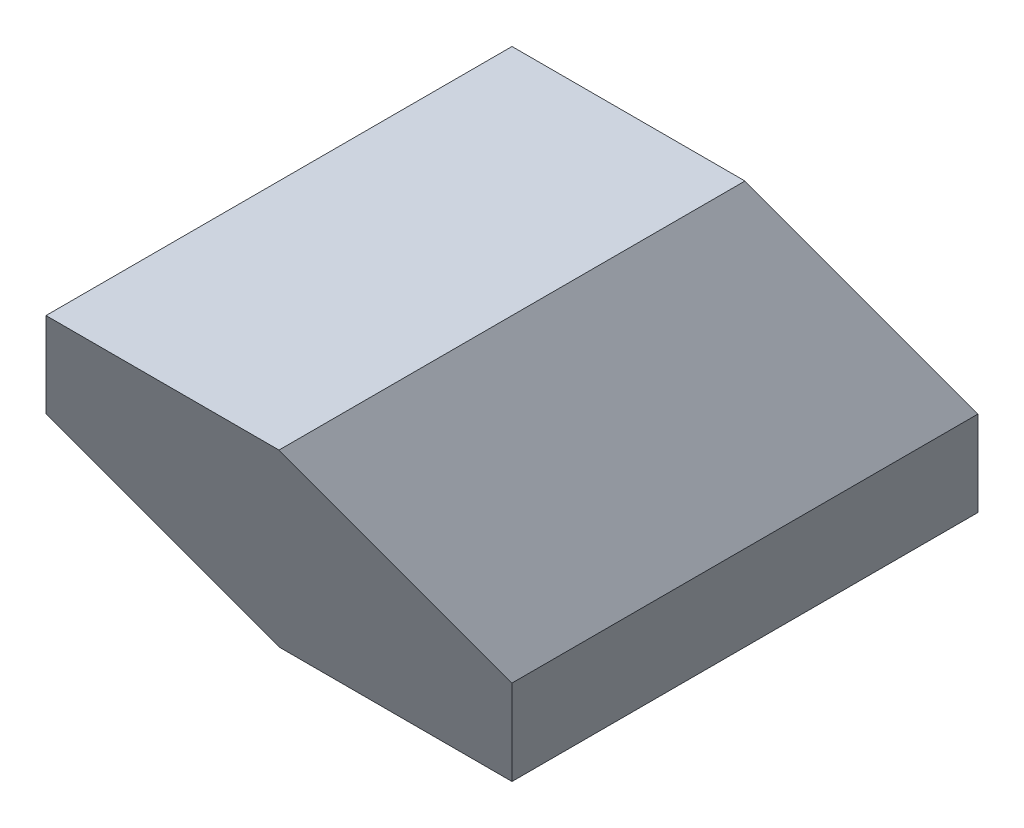
ISO-10303-21;
HEADER;
FILE_DESCRIPTION(('STEP AP214'),'2;1');
FILE_NAME('part.step','',(''),(''),'','','');
FILE_SCHEMA(('AUTOMOTIVE_DESIGN { 1 0 10303 214 1 1 1 1 }'));
ENDSEC;
DATA;
#1=APPLICATION_CONTEXT('core data for automotive mechanical design processes');
#2=APPLICATION_PROTOCOL_DEFINITION('international standard','automotive_design',2000,#1);
#3=PRODUCT_CONTEXT('',#1,'mechanical');
#4=PRODUCT('Part','Part','',(#3));
#5=PRODUCT_RELATED_PRODUCT_CATEGORY('part','',(#4));
#6=PRODUCT_DEFINITION_FORMATION('','',#4);
#7=PRODUCT_DEFINITION_CONTEXT('part definition',#1,'design');
#8=PRODUCT_DEFINITION('design','',#6,#7);
#9=PRODUCT_DEFINITION_SHAPE('','',#8);
#10=(LENGTH_UNIT() NAMED_UNIT(*) SI_UNIT(.MILLI.,.METRE.));
#11=(NAMED_UNIT(*) PLANE_ANGLE_UNIT() SI_UNIT($,.RADIAN.));
#12=(NAMED_UNIT(*) SI_UNIT($,.STERADIAN.) SOLID_ANGLE_UNIT());
#13=UNCERTAINTY_MEASURE_WITH_UNIT(LENGTH_MEASURE(1.E-05),#10,'distance_accuracy_value','');
#14=(GEOMETRIC_REPRESENTATION_CONTEXT(3) GLOBAL_UNCERTAINTY_ASSIGNED_CONTEXT((#13)) GLOBAL_UNIT_ASSIGNED_CONTEXT((#10,
#11,#12)) REPRESENTATION_CONTEXT('',''));
#15=CARTESIAN_POINT('',(0.,0.,0.));
#16=DIRECTION('',(0.,0.,1.));
#17=DIRECTION('',(1.,0.,0.));
#18=AXIS2_PLACEMENT_3D('',#15,#16,#17);
#19=CARTESIAN_POINT('',(0.,0.,0.));
#20=DIRECTION('',(0.,1.,0.));
#21=DIRECTION('',(1.,0.,0.));
#22=AXIS2_PLACEMENT_3D('',#19,#20,#21);
#23=SPHERICAL_SURFACE('',#22,34.9999999999999);
#24=CARTESIAN_POINT('',(0.,-17.4999999999999,30.3108891324553));
#25=VERTEX_POINT('',#24);
#26=VERTEX_LOOP('',#25);
#27=FACE_BOUND('',#26,.T.);
#28=CARTESIAN_POINT('',(0.,17.5000000000003,-30.310889132455));
#29=VERTEX_POINT('',#28);
#30=VERTEX_LOOP('',#29);
#31=FACE_BOUND('',#30,.T.);
#32=ADVANCED_FACE('F40',(#27,#31),#23,.T.);
#33=CLOSED_SHELL('',(#32));
#34=MANIFOLD_SOLID_BREP('B2',#33);
#35=CARTESIAN_POINT('',(20.2072594216366,-35.,65.));
#36=DIRECTION('',(-0.866025403784435,0.500000000000006,0.));
#37=DIRECTION('',(-0.500000000000006,-0.866025403784435,0.));
#38=AXIS2_PLACEMENT_3D('',#35,#36,#37);
#39=PLANE('',#38);
#40=DIRECTION('',(0.,0.,-1.));
#41=VECTOR('',#40,1.);
#42=CARTESIAN_POINT('',(40.4145188432736,-2.70616862252382E-13,65.));
#43=LINE('',#42,#41);
#44=CARTESIAN_POINT('',(40.4145188432736,-2.70616862252382E-13,40.4145188432737));
#45=VERTEX_POINT('',#44);
#46=CARTESIAN_POINT('',(40.4145188432736,-2.77555756156289E-13,-40.4145188432744));
#47=VERTEX_POINT('',#46);
#48=EDGE_CURVE('E38',#45,#47,#43,.T.);
#49=ORIENTED_EDGE('',*,*,#48,.F.);
#50=DIRECTION('',(-0.447213595499964,-0.774596669241482,-0.447213595499955));
#51=VECTOR('',#50,1.);
#52=CARTESIAN_POINT('',(29.1658075373092,-19.4833395016048,29.1658075373096));
#53=LINE('',#52,#51);
#54=CARTESIAN_POINT('',(20.2072594216366,-35.,20.2072594216371));
#55=VERTEX_POINT('',#54);
#56=EDGE_CURVE('E110',#45,#55,#53,.T.);
#57=ORIENTED_EDGE('',*,*,#56,.T.);
#58=DIRECTION('',(0.,0.,-1.));
#59=VECTOR('',#58,1.);
#60=CARTESIAN_POINT('',(20.2072594216366,-35.,65.));
#61=LINE('',#60,#59);
#62=CARTESIAN_POINT('',(20.2072594216366,-35.,-60.6217782649116));
#63=VERTEX_POINT('',#62);
#64=EDGE_CURVE('E80',#55,#63,#61,.T.);
#65=ORIENTED_EDGE('',*,*,#64,.T.);
#66=DIRECTION('',(0.447213595499961,0.774596669241477,0.447213595499966));
#67=VECTOR('',#66,1.);
#68=CARTESIAN_POINT('',(45.3316150746195,8.51666049839615,-35.4974226119284));
#69=LINE('',#68,#67);
#70=EDGE_CURVE('E125',#63,#47,#69,.T.);
#71=ORIENTED_EDGE('',*,*,#70,.T.);
#72=EDGE_LOOP('',(#49,#57,#65,#71));
#73=FACE_BOUND('',#72,.T.);
#74=ADVANCED_FACE('F58',(#73),#39,.F.);
#75=CARTESIAN_POINT('',(40.4145188432736,-2.70616862252382E-13,65.));
#76=DIRECTION('',(-0.866025403784442,-0.499999999999994,0.));
#77=DIRECTION('',(0.499999999999994,-0.866025403784442,0.));
#78=AXIS2_PLACEMENT_3D('',#75,#76,#77);
#79=PLANE('',#78);
#80=DIRECTION('',(0.,0.,-1.));
#81=VECTOR('',#80,1.);
#82=CARTESIAN_POINT('',(20.2072594216371,34.9999999999997,65.));
#83=LINE('',#82,#81);
#84=CARTESIAN_POINT('',(20.207259421637,34.9999999999997,60.6217782649105));
#85=VERTEX_POINT('',#84);
#86=CARTESIAN_POINT('',(20.207259421637,34.9999999999997,-20.207259421637));
#87=VERTEX_POINT('',#86);
#88=EDGE_CURVE('E65',#85,#87,#83,.T.);
#89=ORIENTED_EDGE('',*,*,#88,.F.);
#90=DIRECTION('',(0.447213595499953,-0.774596669241487,-0.447213595499957));
#91=VECTOR('',#90,1.);
#92=CARTESIAN_POINT('',(35.4974226119284,8.51666049839517,45.331615074619));
#93=LINE('',#92,#91);
#94=EDGE_CURVE('E118',#85,#45,#93,.T.);
#95=ORIENTED_EDGE('',*,*,#94,.T.);
#96=ORIENTED_EDGE('',*,*,#48,.T.);
#97=DIRECTION('',(-0.44721359549995,0.774596669241482,0.447213595499969));
#98=VECTOR('',#97,1.);
#99=CARTESIAN_POINT('',(19.3316150746186,36.5166604983961,-19.3316150746185));
#100=LINE('',#99,#98);
#101=EDGE_CURVE('E129',#47,#87,#100,.T.);
#102=ORIENTED_EDGE('',*,*,#101,.T.);
#103=EDGE_LOOP('',(#89,#95,#96,#102));
#104=FACE_BOUND('',#103,.T.);
#105=ADVANCED_FACE('F152',(#104),#79,.F.);
#106=CARTESIAN_POINT('',(20.2072594216371,34.9999999999997,65.));
#107=DIRECTION('',(0.,-1.,0.));
#108=DIRECTION('',(1.,0.,0.));
#109=AXIS2_PLACEMENT_3D('',#106,#107,#108);
#110=PLANE('',#109);
#111=DIRECTION('',(0.,0.,-1.));
#112=VECTOR('',#111,1.);
#113=CARTESIAN_POINT('',(-20.2072594216366,35.,65.));
#114=LINE('',#113,#112);
#115=CARTESIAN_POINT('',(-20.2072594216367,34.9999999999997,60.6217782649105));
#116=VERTEX_POINT('',#115);
#117=CARTESIAN_POINT('',(-20.2072594216368,34.9999999999997,-20.207259421637));
#118=VERTEX_POINT('',#117);
#119=EDGE_CURVE('E134',#116,#118,#114,.T.);
#120=ORIENTED_EDGE('',*,*,#119,.F.);
#121=DIRECTION('',(1.,0.,0.));
#122=VECTOR('',#121,1.);
#123=CARTESIAN_POINT('',(-45.,34.9999999999997,60.6217782649105));
#124=LINE('',#123,#122);
#125=EDGE_CURVE('E114',#116,#85,#124,.T.);
#126=ORIENTED_EDGE('',*,*,#125,.T.);
#127=ORIENTED_EDGE('',*,*,#88,.T.);
#128=DIRECTION('',(1.,0.,0.));
#129=VECTOR('',#128,1.);
#130=CARTESIAN_POINT('',(-45.,34.9999999999997,-20.207259421637));
#131=LINE('',#130,#129);
#132=EDGE_CURVE('E117',#118,#87,#131,.T.);
#133=ORIENTED_EDGE('',*,*,#132,.F.);
#134=EDGE_LOOP('',(#120,#126,#127,#133));
#135=FACE_BOUND('',#134,.T.);
#136=ADVANCED_FACE('F141',(#135),#110,.F.);
#137=CARTESIAN_POINT('',(-20.2072594216366,35.,65.));
#138=DIRECTION('',(0.866025403784435,-0.500000000000006,0.));
#139=DIRECTION('',(0.500000000000006,0.866025403784435,0.));
#140=AXIS2_PLACEMENT_3D('',#137,#138,#139);
#141=PLANE('',#140);
#142=DIRECTION('',(0.,0.,-1.));
#143=VECTOR('',#142,1.);
#144=CARTESIAN_POINT('',(-40.4145188432736,2.82651506366971E-13,65.));
#145=LINE('',#144,#143);
#146=CARTESIAN_POINT('',(-40.4145188432736,2.8275992658422E-13,40.4145188432741));
#147=VERTEX_POINT('',#146);
#148=CARTESIAN_POINT('',(-40.4145188432736,2.91433543964104E-13,-40.414518843274));
#149=VERTEX_POINT('',#148);
#150=EDGE_CURVE('E127',#147,#149,#145,.T.);
#151=ORIENTED_EDGE('',*,*,#150,.F.);
#152=DIRECTION('',(0.447213595499964,0.774596669241482,0.447213595499955));
#153=VECTOR('',#152,1.);
#154=CARTESIAN_POINT('',(-19.3316150746187,36.5166604983954,61.4974226119285));
#155=LINE('',#154,#153);
#156=EDGE_CURVE('E160',#147,#116,#155,.T.);
#157=ORIENTED_EDGE('',*,*,#156,.T.);
#158=ORIENTED_EDGE('',*,*,#119,.T.);
#159=DIRECTION('',(-0.447213595499961,-0.774596669241477,-0.447213595499966));
#160=VECTOR('',#159,1.);
#161=CARTESIAN_POINT('',(-3.16580753730881,64.5166604983956,-3.16580753730886));
#162=LINE('',#161,#160);
#163=EDGE_CURVE('E150',#118,#149,#162,.T.);
#164=ORIENTED_EDGE('',*,*,#163,.T.);
#165=EDGE_LOOP('',(#151,#157,#158,#164));
#166=FACE_BOUND('',#165,.T.);
#167=ADVANCED_FACE('F168',(#166),#141,.F.);
#168=CARTESIAN_POINT('',(-40.4145188432736,2.82651506366971E-13,65.));
#169=DIRECTION('',(0.866025403784442,0.499999999999994,0.));
#170=DIRECTION('',(-0.499999999999994,0.866025403784442,0.));
#171=AXIS2_PLACEMENT_3D('',#168,#169,#170);
#172=PLANE('',#171);
#173=DIRECTION('',(0.,0.,-1.));
#174=VECTOR('',#173,1.);
#175=CARTESIAN_POINT('',(-20.207259421637,-34.9999999999997,65.));
#176=LINE('',#175,#174);
#177=CARTESIAN_POINT('',(-20.207259421637,-34.9999999999997,20.2072594216372));
#178=VERTEX_POINT('',#177);
#179=CARTESIAN_POINT('',(-20.207259421637,-35.,-60.6217782649116));
#180=VERTEX_POINT('',#179);
#181=EDGE_CURVE('E124',#178,#180,#176,.T.);
#182=ORIENTED_EDGE('',*,*,#181,.F.);
#183=DIRECTION('',(-0.447213595499953,0.774596669241487,0.447213595499957));
#184=VECTOR('',#183,1.);
#185=CARTESIAN_POINT('',(-45.3316150746187,8.51666049839561,45.3316150746193));
#186=LINE('',#185,#184);
#187=EDGE_CURVE('E72',#178,#147,#186,.T.);
#188=ORIENTED_EDGE('',*,*,#187,.T.);
#189=ORIENTED_EDGE('',*,*,#150,.T.);
#190=DIRECTION('',(0.44721359549995,-0.774596669241482,-0.447213595499968));
#191=VECTOR('',#190,1.);
#192=CARTESIAN_POINT('',(-61.4974226119285,36.5166604983966,-19.3316150746182));
#193=LINE('',#192,#191);
#194=EDGE_CURVE('E153',#149,#180,#193,.T.);
#195=ORIENTED_EDGE('',*,*,#194,.T.);
#196=EDGE_LOOP('',(#182,#188,#189,#195));
#197=FACE_BOUND('',#196,.T.);
#198=ADVANCED_FACE('F166',(#197),#172,.F.);
#199=CARTESIAN_POINT('',(-20.207259421637,-34.9999999999997,65.));
#200=DIRECTION('',(0.,1.,0.));
#201=DIRECTION('',(-1.,0.,0.));
#202=AXIS2_PLACEMENT_3D('',#199,#200,#201);
#203=PLANE('',#202);
#204=ORIENTED_EDGE('',*,*,#64,.F.);
#205=DIRECTION('',(1.,0.,0.));
#206=VECTOR('',#205,1.);
#207=CARTESIAN_POINT('',(-45.,-35.,20.2072594216371));
#208=LINE('',#207,#206);
#209=EDGE_CURVE('E108',#178,#55,#208,.T.);
#210=ORIENTED_EDGE('',*,*,#209,.F.);
#211=ORIENTED_EDGE('',*,*,#181,.T.);
#212=DIRECTION('',(1.,0.,0.));
#213=VECTOR('',#212,1.);
#214=CARTESIAN_POINT('',(-45.,-35.,-60.6217782649116));
#215=LINE('',#214,#213);
#216=EDGE_CURVE('E123',#180,#63,#215,.T.);
#217=ORIENTED_EDGE('',*,*,#216,.T.);
#218=EDGE_LOOP('',(#204,#210,#211,#217));
#219=FACE_BOUND('',#218,.T.);
#220=ADVANCED_FACE('F121',(#219),#203,.F.);
#221=CARTESIAN_POINT('',(-45.,34.9999999999997,-20.207259421637));
#222=DIRECTION('',(0.,-0.50000000000001,0.866025403784433));
#223=DIRECTION('',(0.,-0.866025403784433,-0.50000000000001));
#224=AXIS2_PLACEMENT_3D('',#221,#222,#223);
#225=PLANE('',#224);
#226=ORIENTED_EDGE('',*,*,#216,.F.);
#227=ORIENTED_EDGE('',*,*,#194,.F.);
#228=ORIENTED_EDGE('',*,*,#163,.F.);
#229=ORIENTED_EDGE('',*,*,#132,.T.);
#230=ORIENTED_EDGE('',*,*,#101,.F.);
#231=ORIENTED_EDGE('',*,*,#70,.F.);
#232=EDGE_LOOP('',(#226,#227,#228,#229,#230,#231));
#233=FACE_BOUND('',#232,.T.);
#234=ADVANCED_FACE('F147',(#233),#225,.F.);
#235=CARTESIAN_POINT('',(-45.,34.9999999999997,60.6217782649105));
#236=DIRECTION('',(0.,0.499999999999998,-0.86602540378444));
#237=DIRECTION('',(0.,0.86602540378444,0.499999999999998));
#238=AXIS2_PLACEMENT_3D('',#235,#236,#237);
#239=PLANE('',#238);
#240=ORIENTED_EDGE('',*,*,#94,.F.);
#241=ORIENTED_EDGE('',*,*,#125,.F.);
#242=ORIENTED_EDGE('',*,*,#156,.F.);
#243=ORIENTED_EDGE('',*,*,#187,.F.);
#244=ORIENTED_EDGE('',*,*,#209,.T.);
#245=ORIENTED_EDGE('',*,*,#56,.F.);
#246=EDGE_LOOP('',(#240,#241,#242,#243,#244,#245));
#247=FACE_BOUND('',#246,.T.);
#248=ADVANCED_FACE('F109',(#247),#239,.F.);
#249=CLOSED_SHELL('',(#74,#105,#136,#167,#198,#220,#234,#248));
#250=MANIFOLD_SOLID_BREP('B6',#249);
#251=ADVANCED_BREP_SHAPE_REPRESENTATION('',(#18,#34,#250),#14);
#252=SHAPE_DEFINITION_REPRESENTATION(#9,#251);
ENDSEC;
END-ISO-10303-21;
